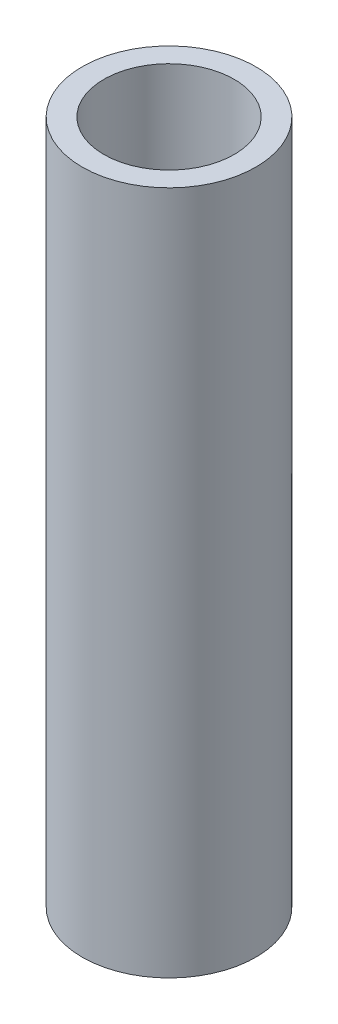
ISO-10303-21;
HEADER;
FILE_DESCRIPTION(('STEP AP214'),'2;1');
FILE_NAME('part.step','',(''),(''),'','','');
FILE_SCHEMA(('AUTOMOTIVE_DESIGN { 1 0 10303 214 1 1 1 1 }'));
ENDSEC;
DATA;
#1=APPLICATION_CONTEXT('core data for automotive mechanical design processes');
#2=APPLICATION_PROTOCOL_DEFINITION('international standard','automotive_design',2000,#1);
#3=PRODUCT_CONTEXT('',#1,'mechanical');
#4=PRODUCT('Part','Part','',(#3));
#5=PRODUCT_RELATED_PRODUCT_CATEGORY('part','',(#4));
#6=PRODUCT_DEFINITION_FORMATION('','',#4);
#7=PRODUCT_DEFINITION_CONTEXT('part definition',#1,'design');
#8=PRODUCT_DEFINITION('design','',#6,#7);
#9=PRODUCT_DEFINITION_SHAPE('','',#8);
#10=(LENGTH_UNIT() NAMED_UNIT(*) SI_UNIT(.MILLI.,.METRE.));
#11=(NAMED_UNIT(*) PLANE_ANGLE_UNIT() SI_UNIT($,.RADIAN.));
#12=(NAMED_UNIT(*) SI_UNIT($,.STERADIAN.) SOLID_ANGLE_UNIT());
#13=UNCERTAINTY_MEASURE_WITH_UNIT(LENGTH_MEASURE(1.E-05),#10,'distance_accuracy_value','');
#14=(GEOMETRIC_REPRESENTATION_CONTEXT(3) GLOBAL_UNCERTAINTY_ASSIGNED_CONTEXT((#13)) GLOBAL_UNIT_ASSIGNED_CONTEXT((#10,
#11,#12)) REPRESENTATION_CONTEXT('',''));
#15=CARTESIAN_POINT('',(0.,0.,0.));
#16=DIRECTION('',(0.,0.,1.));
#17=DIRECTION('',(1.,0.,0.));
#18=AXIS2_PLACEMENT_3D('',#15,#16,#17);
#19=CARTESIAN_POINT('',(0.,200.,0.));
#20=DIRECTION('',(0.,1.,0.));
#21=DIRECTION('',(0.,0.,1.));
#22=AXIS2_PLACEMENT_3D('',#19,#20,#21);
#23=PLANE('',#22);
#24=CARTESIAN_POINT('',(0.,200.,0.));
#25=DIRECTION('',(0.,1.,0.));
#26=DIRECTION('',(0.,0.,1.));
#27=AXIS2_PLACEMENT_3D('',#24,#25,#26);
#28=CIRCLE('',#27,25.4);
#29=CARTESIAN_POINT('',(0.,200.,25.4));
#30=VERTEX_POINT('',#29);
#31=EDGE_CURVE('E10',#30,#30,#28,.T.);
#32=ORIENTED_EDGE('',*,*,#31,.T.);
#33=EDGE_LOOP('',(#32));
#34=FACE_BOUND('',#33,.T.);
#35=CARTESIAN_POINT('',(0.,200.,0.));
#36=DIRECTION('',(0.,1.,0.));
#37=DIRECTION('',(0.,0.,1.));
#38=AXIS2_PLACEMENT_3D('',#35,#36,#37);
#39=CIRCLE('',#38,19.05);
#40=CARTESIAN_POINT('',(0.,200.,19.05));
#41=VERTEX_POINT('',#40);
#42=EDGE_CURVE('E44',#41,#41,#39,.T.);
#43=ORIENTED_EDGE('',*,*,#42,.F.);
#44=EDGE_LOOP('',(#43));
#45=FACE_BOUND('',#44,.T.);
#46=ADVANCED_FACE('F33',(#34,#45),#23,.T.);
#47=CARTESIAN_POINT('',(0.,0.,0.));
#48=DIRECTION('',(0.,1.,0.));
#49=DIRECTION('',(0.,0.,1.));
#50=AXIS2_PLACEMENT_3D('',#47,#48,#49);
#51=PLANE('',#50);
#52=CARTESIAN_POINT('',(0.,0.,0.));
#53=DIRECTION('',(0.,1.,0.));
#54=DIRECTION('',(0.,0.,1.));
#55=AXIS2_PLACEMENT_3D('',#52,#53,#54);
#56=CIRCLE('',#55,25.4);
#57=CARTESIAN_POINT('',(0.,0.,25.4));
#58=VERTEX_POINT('',#57);
#59=EDGE_CURVE('E37',#58,#58,#56,.T.);
#60=ORIENTED_EDGE('',*,*,#59,.F.);
#61=EDGE_LOOP('',(#60));
#62=FACE_BOUND('',#61,.T.);
#63=CARTESIAN_POINT('',(0.,0.,0.));
#64=DIRECTION('',(0.,1.,0.));
#65=DIRECTION('',(0.,0.,1.));
#66=AXIS2_PLACEMENT_3D('',#63,#64,#65);
#67=CIRCLE('',#66,19.05);
#68=CARTESIAN_POINT('',(0.,0.,19.05));
#69=VERTEX_POINT('',#68);
#70=EDGE_CURVE('E46',#69,#69,#67,.T.);
#71=ORIENTED_EDGE('',*,*,#70,.T.);
#72=EDGE_LOOP('',(#71));
#73=FACE_BOUND('',#72,.T.);
#74=ADVANCED_FACE('F56',(#62,#73),#51,.F.);
#75=CARTESIAN_POINT('',(0.,200.,0.));
#76=DIRECTION('',(0.,-1.,0.));
#77=DIRECTION('',(0.,0.,-1.));
#78=AXIS2_PLACEMENT_3D('',#75,#76,#77);
#79=CYLINDRICAL_SURFACE('',#78,25.4);
#80=ORIENTED_EDGE('',*,*,#31,.F.);
#81=EDGE_LOOP('',(#80));
#82=FACE_BOUND('',#81,.T.);
#83=ORIENTED_EDGE('',*,*,#59,.T.);
#84=EDGE_LOOP('',(#83));
#85=FACE_BOUND('',#84,.T.);
#86=ADVANCED_FACE('F35',(#82,#85),#79,.T.);
#87=CARTESIAN_POINT('',(0.,200.,0.));
#88=DIRECTION('',(0.,-1.,0.));
#89=DIRECTION('',(0.,0.,-1.));
#90=AXIS2_PLACEMENT_3D('',#87,#88,#89);
#91=CYLINDRICAL_SURFACE('',#90,19.05);
#92=ORIENTED_EDGE('',*,*,#42,.T.);
#93=EDGE_LOOP('',(#92));
#94=FACE_BOUND('',#93,.T.);
#95=ORIENTED_EDGE('',*,*,#70,.F.);
#96=EDGE_LOOP('',(#95));
#97=FACE_BOUND('',#96,.T.);
#98=ADVANCED_FACE('F52',(#94,#97),#91,.F.);
#99=CLOSED_SHELL('',(#46,#74,#86,#98));
#100=MANIFOLD_SOLID_BREP('B2',#99);
#101=ADVANCED_BREP_SHAPE_REPRESENTATION('',(#18,#100),#14);
#102=SHAPE_DEFINITION_REPRESENTATION(#9,#101);
ENDSEC;
END-ISO-10303-21;
